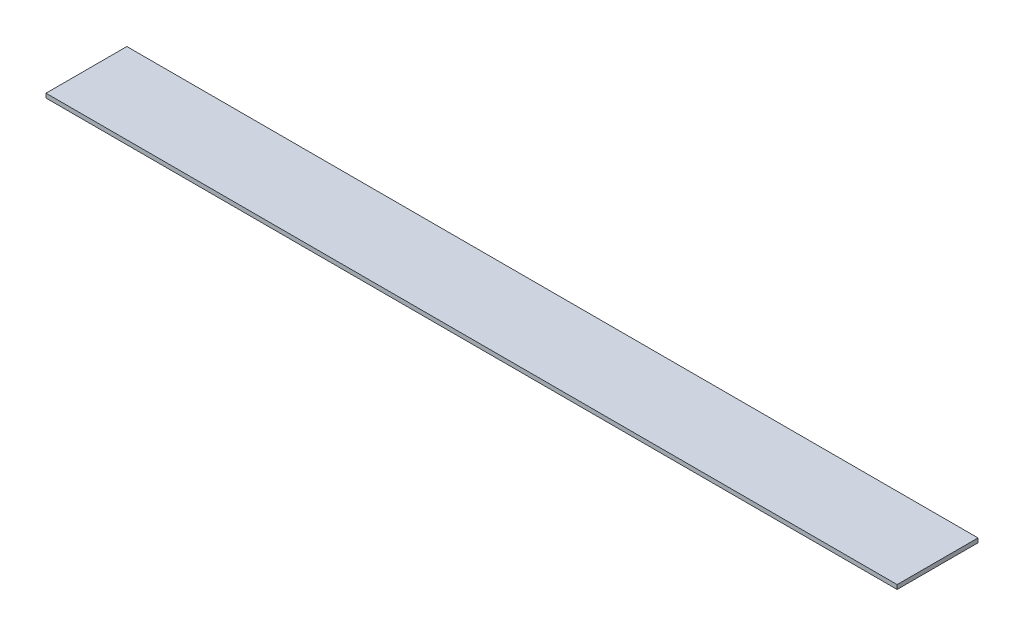
ISO-10303-21;
HEADER;
FILE_DESCRIPTION(('STEP AP214'),'2;1');
FILE_NAME('part.step','',(''),(''),'','','');
FILE_SCHEMA(('AUTOMOTIVE_DESIGN { 1 0 10303 214 1 1 1 1 }'));
ENDSEC;
DATA;
#1=APPLICATION_CONTEXT('core data for automotive mechanical design processes');
#2=APPLICATION_PROTOCOL_DEFINITION('international standard','automotive_design',2000,#1);
#3=PRODUCT_CONTEXT('',#1,'mechanical');
#4=PRODUCT('Part','Part','',(#3));
#5=PRODUCT_RELATED_PRODUCT_CATEGORY('part','',(#4));
#6=PRODUCT_DEFINITION_FORMATION('','',#4);
#7=PRODUCT_DEFINITION_CONTEXT('part definition',#1,'design');
#8=PRODUCT_DEFINITION('design','',#6,#7);
#9=PRODUCT_DEFINITION_SHAPE('','',#8);
#10=(LENGTH_UNIT() NAMED_UNIT(*) SI_UNIT(.MILLI.,.METRE.));
#11=(NAMED_UNIT(*) PLANE_ANGLE_UNIT() SI_UNIT($,.RADIAN.));
#12=(NAMED_UNIT(*) SI_UNIT($,.STERADIAN.) SOLID_ANGLE_UNIT());
#13=UNCERTAINTY_MEASURE_WITH_UNIT(LENGTH_MEASURE(1.E-05),#10,'distance_accuracy_value','');
#14=(GEOMETRIC_REPRESENTATION_CONTEXT(3) GLOBAL_UNCERTAINTY_ASSIGNED_CONTEXT((#13)) GLOBAL_UNIT_ASSIGNED_CONTEXT((#10,
#11,#12)) REPRESENTATION_CONTEXT('',''));
#15=CARTESIAN_POINT('',(0.,0.,0.));
#16=DIRECTION('',(0.,0.,1.));
#17=DIRECTION('',(1.,0.,0.));
#18=AXIS2_PLACEMENT_3D('',#15,#16,#17);
#19=CARTESIAN_POINT('',(-300.,0.,60.));
#20=DIRECTION('',(0.,0.,1.));
#21=DIRECTION('',(1.,0.,0.));
#22=AXIS2_PLACEMENT_3D('',#19,#20,#21);
#23=PLANE('',#22);
#24=DIRECTION('',(-1.,0.,0.));
#25=VECTOR('',#24,1.);
#26=CARTESIAN_POINT('',(-300.,50.,60.));
#27=LINE('',#26,#25);
#28=CARTESIAN_POINT('',(300.,50.,60.));
#29=VERTEX_POINT('',#28);
#30=CARTESIAN_POINT('',(-300.,50.,60.));
#31=VERTEX_POINT('',#30);
#32=EDGE_CURVE('E91',#29,#31,#27,.T.);
#33=ORIENTED_EDGE('',*,*,#32,.T.);
#34=DIRECTION('',(0.,-1.,0.));
#35=VECTOR('',#34,1.);
#36=CARTESIAN_POINT('',(-300.,0.,60.));
#37=LINE('',#36,#35);
#38=CARTESIAN_POINT('',(-300.,47.,60.));
#39=VERTEX_POINT('',#38);
#40=EDGE_CURVE('E76',#31,#39,#37,.T.);
#41=ORIENTED_EDGE('',*,*,#40,.T.);
#42=DIRECTION('',(-1.,0.,0.));
#43=VECTOR('',#42,1.);
#44=CARTESIAN_POINT('',(300.,47.,60.));
#45=LINE('',#44,#43);
#46=CARTESIAN_POINT('',(300.,47.,60.));
#47=VERTEX_POINT('',#46);
#48=EDGE_CURVE('E81',#47,#39,#45,.T.);
#49=ORIENTED_EDGE('',*,*,#48,.F.);
#50=DIRECTION('',(0.,-1.,0.));
#51=VECTOR('',#50,1.);
#52=CARTESIAN_POINT('',(300.,3.43367945760358E-13,60.));
#53=LINE('',#52,#51);
#54=EDGE_CURVE('E93',#29,#47,#53,.T.);
#55=ORIENTED_EDGE('',*,*,#54,.F.);
#56=EDGE_LOOP('',(#33,#41,#49,#55));
#57=FACE_BOUND('',#56,.T.);
#58=ADVANCED_FACE('F32',(#57),#23,.T.);
#59=CARTESIAN_POINT('',(0.,0.,3.));
#60=DIRECTION('',(0.,0.,1.));
#61=DIRECTION('',(1.,0.,0.));
#62=AXIS2_PLACEMENT_3D('',#59,#60,#61);
#63=PLANE('',#62);
#64=DIRECTION('',(0.,1.,0.));
#65=VECTOR('',#64,1.);
#66=CARTESIAN_POINT('',(-300.,0.,3.));
#67=LINE('',#66,#65);
#68=CARTESIAN_POINT('',(-300.,47.,3.));
#69=VERTEX_POINT('',#68);
#70=CARTESIAN_POINT('',(-300.,50.,3.));
#71=VERTEX_POINT('',#70);
#72=EDGE_CURVE('E11',#69,#71,#67,.T.);
#73=ORIENTED_EDGE('',*,*,#72,.T.);
#74=DIRECTION('',(-1.,0.,0.));
#75=VECTOR('',#74,1.);
#76=CARTESIAN_POINT('',(-300.,50.,3.));
#77=LINE('',#76,#75);
#78=CARTESIAN_POINT('',(300.,50.,3.));
#79=VERTEX_POINT('',#78);
#80=EDGE_CURVE('E88',#79,#71,#77,.T.);
#81=ORIENTED_EDGE('',*,*,#80,.F.);
#82=DIRECTION('',(0.,1.,0.));
#83=VECTOR('',#82,1.);
#84=CARTESIAN_POINT('',(300.,1.71683972880179E-13,3.));
#85=LINE('',#84,#83);
#86=CARTESIAN_POINT('',(300.,47.,3.));
#87=VERTEX_POINT('',#86);
#88=EDGE_CURVE('E41',#87,#79,#85,.T.);
#89=ORIENTED_EDGE('',*,*,#88,.F.);
#90=DIRECTION('',(1.,0.,0.));
#91=VECTOR('',#90,1.);
#92=CARTESIAN_POINT('',(300.,47.,3.));
#93=LINE('',#92,#91);
#94=EDGE_CURVE('E36',#69,#87,#93,.T.);
#95=ORIENTED_EDGE('',*,*,#94,.F.);
#96=EDGE_LOOP('',(#73,#81,#89,#95));
#97=FACE_BOUND('',#96,.T.);
#98=ADVANCED_FACE('F34',(#97),#63,.F.);
#99=CARTESIAN_POINT('',(300.,47.,3.));
#100=DIRECTION('',(0.,1.,0.));
#101=DIRECTION('',(0.,0.,1.));
#102=AXIS2_PLACEMENT_3D('',#99,#100,#101);
#103=PLANE('',#102);
#104=DIRECTION('',(0.,0.,1.));
#105=VECTOR('',#104,1.);
#106=CARTESIAN_POINT('',(-300.,47.,3.));
#107=LINE('',#106,#105);
#108=EDGE_CURVE('E71',#69,#39,#107,.T.);
#109=ORIENTED_EDGE('',*,*,#108,.F.);
#110=ORIENTED_EDGE('',*,*,#94,.T.);
#111=DIRECTION('',(0.,0.,1.));
#112=VECTOR('',#111,1.);
#113=CARTESIAN_POINT('',(300.,47.,3.));
#114=LINE('',#113,#112);
#115=EDGE_CURVE('E84',#87,#47,#114,.T.);
#116=ORIENTED_EDGE('',*,*,#115,.T.);
#117=ORIENTED_EDGE('',*,*,#48,.T.);
#118=EDGE_LOOP('',(#109,#110,#116,#117));
#119=FACE_BOUND('',#118,.T.);
#120=ADVANCED_FACE('F82',(#119),#103,.F.);
#121=CARTESIAN_POINT('',(-300.,50.,60.));
#122=DIRECTION('',(0.,-1.,0.));
#123=DIRECTION('',(0.,0.,-1.));
#124=AXIS2_PLACEMENT_3D('',#121,#122,#123);
#125=PLANE('',#124);
#126=DIRECTION('',(0.,0.,-1.));
#127=VECTOR('',#126,1.);
#128=CARTESIAN_POINT('',(300.,50.,60.));
#129=LINE('',#128,#127);
#130=EDGE_CURVE('E92',#29,#79,#129,.T.);
#131=ORIENTED_EDGE('',*,*,#130,.T.);
#132=ORIENTED_EDGE('',*,*,#80,.T.);
#133=DIRECTION('',(0.,0.,-1.));
#134=VECTOR('',#133,1.);
#135=CARTESIAN_POINT('',(-300.,50.,60.));
#136=LINE('',#135,#134);
#137=EDGE_CURVE('E78',#31,#71,#136,.T.);
#138=ORIENTED_EDGE('',*,*,#137,.F.);
#139=ORIENTED_EDGE('',*,*,#32,.F.);
#140=EDGE_LOOP('',(#131,#132,#138,#139));
#141=FACE_BOUND('',#140,.T.);
#142=ADVANCED_FACE('F105',(#141),#125,.F.);
#143=CARTESIAN_POINT('',(-300.,0.,0.));
#144=DIRECTION('',(-1.,0.,0.));
#145=DIRECTION('',(0.,0.,1.));
#146=AXIS2_PLACEMENT_3D('',#143,#144,#145);
#147=PLANE('',#146);
#148=ORIENTED_EDGE('',*,*,#72,.F.);
#149=ORIENTED_EDGE('',*,*,#108,.T.);
#150=ORIENTED_EDGE('',*,*,#40,.F.);
#151=ORIENTED_EDGE('',*,*,#137,.T.);
#152=EDGE_LOOP('',(#148,#149,#150,#151));
#153=FACE_BOUND('',#152,.T.);
#154=ADVANCED_FACE('F73',(#153),#147,.T.);
#155=CARTESIAN_POINT('',(300.,1.71683972880179E-13,0.));
#156=DIRECTION('',(-1.,0.,0.));
#157=DIRECTION('',(0.,-1.,0.));
#158=AXIS2_PLACEMENT_3D('',#155,#156,#157);
#159=PLANE('',#158);
#160=ORIENTED_EDGE('',*,*,#115,.F.);
#161=ORIENTED_EDGE('',*,*,#88,.T.);
#162=ORIENTED_EDGE('',*,*,#130,.F.);
#163=ORIENTED_EDGE('',*,*,#54,.T.);
#164=EDGE_LOOP('',(#160,#161,#162,#163));
#165=FACE_BOUND('',#164,.T.);
#166=ADVANCED_FACE('F103',(#165),#159,.F.);
#167=CLOSED_SHELL('',(#58,#98,#120,#142,#154,#166));
#168=MANIFOLD_SOLID_BREP('B2',#167);
#169=ADVANCED_BREP_SHAPE_REPRESENTATION('',(#18,#168),#14);
#170=SHAPE_DEFINITION_REPRESENTATION(#9,#169);
ENDSEC;
END-ISO-10303-21;
